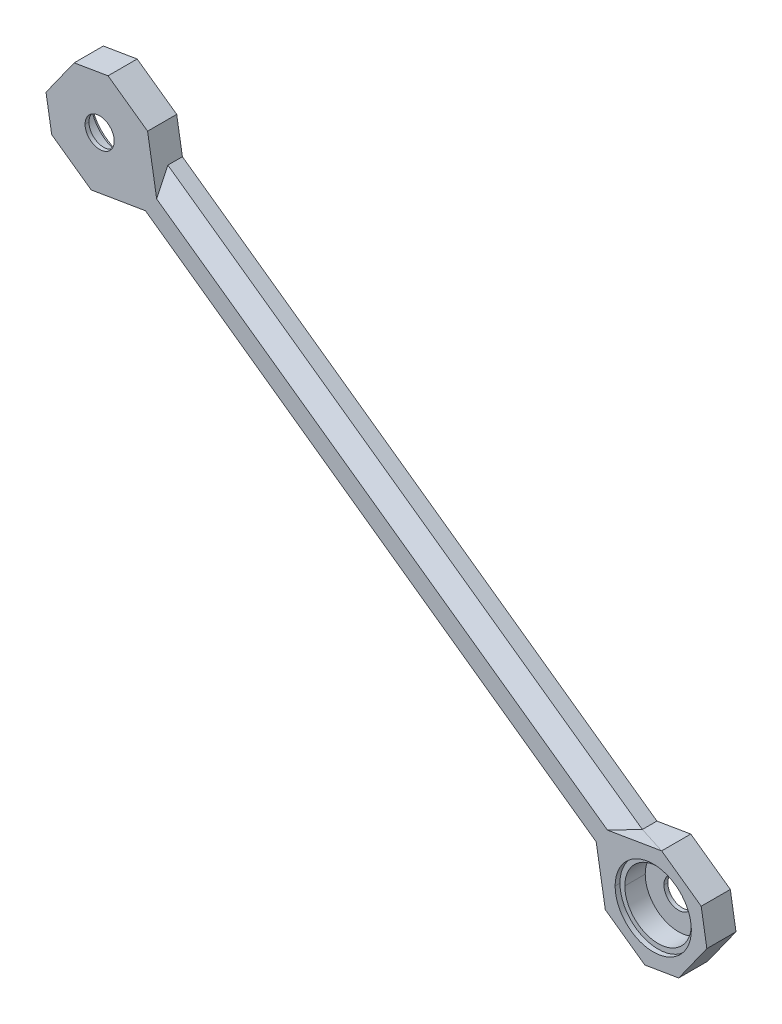
ISO-10303-21;
HEADER;
FILE_DESCRIPTION(('STEP AP214'),'2;1');
FILE_NAME('part.step','',(''),(''),'','','');
FILE_SCHEMA(('AUTOMOTIVE_DESIGN { 1 0 10303 214 1 1 1 1 }'));
ENDSEC;
DATA;
#1=APPLICATION_CONTEXT('core data for automotive mechanical design processes');
#2=APPLICATION_PROTOCOL_DEFINITION('international standard','automotive_design',2000,#1);
#3=PRODUCT_CONTEXT('',#1,'mechanical');
#4=PRODUCT('Part','Part','',(#3));
#5=PRODUCT_RELATED_PRODUCT_CATEGORY('part','',(#4));
#6=PRODUCT_DEFINITION_FORMATION('','',#4);
#7=PRODUCT_DEFINITION_CONTEXT('part definition',#1,'design');
#8=PRODUCT_DEFINITION('design','',#6,#7);
#9=PRODUCT_DEFINITION_SHAPE('','',#8);
#10=(LENGTH_UNIT() NAMED_UNIT(*) SI_UNIT(.MILLI.,.METRE.));
#11=(NAMED_UNIT(*) PLANE_ANGLE_UNIT() SI_UNIT($,.RADIAN.));
#12=(NAMED_UNIT(*) SI_UNIT($,.STERADIAN.) SOLID_ANGLE_UNIT());
#13=UNCERTAINTY_MEASURE_WITH_UNIT(LENGTH_MEASURE(1.E-05),#10,'distance_accuracy_value','');
#14=(GEOMETRIC_REPRESENTATION_CONTEXT(3) GLOBAL_UNCERTAINTY_ASSIGNED_CONTEXT((#13)) GLOBAL_UNIT_ASSIGNED_CONTEXT((#10,
#11,#12)) REPRESENTATION_CONTEXT('',''));
#15=CARTESIAN_POINT('',(0.,0.,0.));
#16=DIRECTION('',(0.,0.,1.));
#17=DIRECTION('',(1.,0.,0.));
#18=AXIS2_PLACEMENT_3D('',#15,#16,#17);
#19=CARTESIAN_POINT('',(24.6033055355398,-560.848772474689,6.00011084027172));
#20=DIRECTION('',(0.,0.,-1.));
#21=DIRECTION('',(-1.,0.,0.));
#22=AXIS2_PLACEMENT_3D('',#19,#20,#21);
#23=CYLINDRICAL_SURFACE('',#22,3.);
#24=DIRECTION('',(0.,0.,-1.));
#25=VECTOR('',#24,1.);
#26=CARTESIAN_POINT('',(27.6033055355398,-560.848772474689,6.00011084027172));
#27=LINE('',#26,#25);
#28=CARTESIAN_POINT('',(27.6033055355398,-560.848772474689,0.800000052154064));
#29=VERTEX_POINT('',#28);
#30=CARTESIAN_POINT('',(27.6033055355398,-560.848772474689,0.));
#31=VERTEX_POINT('',#30);
#32=EDGE_CURVE('E645',#29,#31,#27,.T.);
#33=ORIENTED_EDGE('',*,*,#32,.F.);
#34=CARTESIAN_POINT('',(24.6033055355398,-560.848772474689,0.800000052154064));
#35=DIRECTION('',(0.,0.,1.));
#36=DIRECTION('',(1.,0.,0.));
#37=AXIS2_PLACEMENT_3D('',#34,#35,#36);
#38=CIRCLE('',#37,3.);
#39=CARTESIAN_POINT('',(21.6033055355398,-560.848772474689,0.800000052154064));
#40=VERTEX_POINT('',#39);
#41=EDGE_CURVE('E26',#29,#40,#38,.T.);
#42=ORIENTED_EDGE('',*,*,#41,.T.);
#43=DIRECTION('',(0.,0.,-1.));
#44=VECTOR('',#43,1.);
#45=CARTESIAN_POINT('',(21.6033055355398,-560.848772474689,6.00011084027172));
#46=LINE('',#45,#44);
#47=CARTESIAN_POINT('',(21.6033055355398,-560.848772474689,0.));
#48=VERTEX_POINT('',#47);
#49=EDGE_CURVE('E616',#40,#48,#46,.T.);
#50=ORIENTED_EDGE('',*,*,#49,.T.);
#51=CARTESIAN_POINT('',(24.6033055355398,-560.848772474689,0.));
#52=DIRECTION('',(0.,0.,-1.));
#53=DIRECTION('',(-1.,0.,0.));
#54=AXIS2_PLACEMENT_3D('',#51,#52,#53);
#55=CIRCLE('',#54,3.);
#56=EDGE_CURVE('E338',#48,#31,#55,.T.);
#57=ORIENTED_EDGE('',*,*,#56,.T.);
#58=EDGE_LOOP('',(#33,#42,#50,#57));
#59=FACE_BOUND('',#58,.T.);
#60=ADVANCED_FACE('F16',(#59),#23,.F.);
#61=CARTESIAN_POINT('',(24.6033055355398,-560.848772474689,5.00000005215406));
#62=DIRECTION('',(0.,0.,1.));
#63=DIRECTION('',(1.,0.,0.));
#64=AXIS2_PLACEMENT_3D('',#61,#62,#63);
#65=CYLINDRICAL_SURFACE('',#64,7.85);
#66=DIRECTION('',(0.,0.,1.));
#67=VECTOR('',#66,1.);
#68=CARTESIAN_POINT('',(16.7533055355397,-560.848772474689,5.00000005215406));
#69=LINE('',#68,#67);
#70=CARTESIAN_POINT('',(16.7533055355397,-560.848772474689,5.00000005215406));
#71=VERTEX_POINT('',#70);
#72=CARTESIAN_POINT('',(16.7533055355397,-560.848772474689,6.00000005215406));
#73=VERTEX_POINT('',#72);
#74=EDGE_CURVE('E323',#71,#73,#69,.T.);
#75=ORIENTED_EDGE('',*,*,#74,.F.);
#76=CARTESIAN_POINT('',(24.6033055355398,-560.848772474689,5.00000005215406));
#77=DIRECTION('',(0.,0.,1.));
#78=DIRECTION('',(1.,0.,0.));
#79=AXIS2_PLACEMENT_3D('',#76,#77,#78);
#80=CIRCLE('',#79,7.85);
#81=CARTESIAN_POINT('',(32.4533055355398,-560.848772474689,5.00000005215406));
#82=VERTEX_POINT('',#81);
#83=EDGE_CURVE('E11',#82,#71,#80,.T.);
#84=ORIENTED_EDGE('',*,*,#83,.F.);
#85=DIRECTION('',(0.,0.,1.));
#86=VECTOR('',#85,1.);
#87=CARTESIAN_POINT('',(32.4533055355398,-560.848772474689,5.00000005215406));
#88=LINE('',#87,#86);
#89=CARTESIAN_POINT('',(32.4533055355398,-560.848772474689,6.00000005215406));
#90=VERTEX_POINT('',#89);
#91=EDGE_CURVE('E313',#82,#90,#88,.T.);
#92=ORIENTED_EDGE('',*,*,#91,.T.);
#93=CARTESIAN_POINT('',(24.6033055355398,-560.848772474689,6.00000005215406));
#94=DIRECTION('',(0.,0.,1.));
#95=DIRECTION('',(1.,0.,0.));
#96=AXIS2_PLACEMENT_3D('',#93,#94,#95);
#97=CIRCLE('',#96,7.85);
#98=EDGE_CURVE('E296',#90,#73,#97,.T.);
#99=ORIENTED_EDGE('',*,*,#98,.T.);
#100=EDGE_LOOP('',(#75,#84,#92,#99));
#101=FACE_BOUND('',#100,.T.);
#102=ADVANCED_FACE('F18',(#101),#65,.F.);
#103=CARTESIAN_POINT('',(24.6033055355398,-560.848772474689,5.00000005215406));
#104=DIRECTION('',(0.,0.,1.));
#105=DIRECTION('',(1.,0.,0.));
#106=AXIS2_PLACEMENT_3D('',#103,#104,#105);
#107=PLANE('',#106);
#108=CARTESIAN_POINT('',(24.6033055355398,-560.848772474689,5.00000005215406));
#109=DIRECTION('',(0.,0.,-1.));
#110=DIRECTION('',(1.,0.,0.));
#111=AXIS2_PLACEMENT_3D('',#108,#109,#110);
#112=CIRCLE('',#111,6.85);
#113=CARTESIAN_POINT('',(31.4533055355398,-560.848772474689,5.00000005215406));
#114=VERTEX_POINT('',#113);
#115=CARTESIAN_POINT('',(17.7533055355397,-560.848772474689,5.00000005215406));
#116=VERTEX_POINT('',#115);
#117=EDGE_CURVE('E393',#114,#116,#112,.T.);
#118=ORIENTED_EDGE('',*,*,#117,.T.);
#119=CARTESIAN_POINT('',(24.6033055355398,-560.848772474689,5.00000005215406));
#120=DIRECTION('',(0.,0.,-1.));
#121=DIRECTION('',(1.,0.,0.));
#122=AXIS2_PLACEMENT_3D('',#119,#120,#121);
#123=CIRCLE('',#122,6.85);
#124=EDGE_CURVE('E356',#116,#114,#123,.T.);
#125=ORIENTED_EDGE('',*,*,#124,.T.);
#126=EDGE_LOOP('',(#118,#125));
#127=FACE_BOUND('',#126,.T.);
#128=ORIENTED_EDGE('',*,*,#83,.T.);
#129=CARTESIAN_POINT('',(24.6033055355398,-560.848772474689,5.00000005215406));
#130=DIRECTION('',(0.,0.,1.));
#131=DIRECTION('',(1.,0.,0.));
#132=AXIS2_PLACEMENT_3D('',#129,#130,#131);
#133=CIRCLE('',#132,7.85);
#134=EDGE_CURVE('E619',#71,#82,#133,.T.);
#135=ORIENTED_EDGE('',*,*,#134,.T.);
#136=EDGE_LOOP('',(#128,#135));
#137=FACE_BOUND('',#136,.T.);
#138=ADVANCED_FACE('F754',(#127,#137),#107,.T.);
#139=CARTESIAN_POINT('',(24.6033055355398,-560.848772474689,0.800000052154064));
#140=DIRECTION('',(0.,0.,1.));
#141=DIRECTION('',(1.,0.,0.));
#142=AXIS2_PLACEMENT_3D('',#139,#140,#141);
#143=PLANE('',#142);
#144=CARTESIAN_POINT('',(24.6033055355398,-560.848772474689,0.800000052154064));
#145=DIRECTION('',(0.,0.,1.));
#146=DIRECTION('',(1.,0.,0.));
#147=AXIS2_PLACEMENT_3D('',#144,#145,#146);
#148=CIRCLE('',#147,3.);
#149=EDGE_CURVE('E651',#40,#29,#148,.T.);
#150=ORIENTED_EDGE('',*,*,#149,.F.);
#151=ORIENTED_EDGE('',*,*,#41,.F.);
#152=EDGE_LOOP('',(#150,#151));
#153=FACE_BOUND('',#152,.T.);
#154=CARTESIAN_POINT('',(24.6033055355398,-560.848772474689,0.800000052154064));
#155=DIRECTION('',(0.,0.,1.));
#156=DIRECTION('',(1.,0.,0.));
#157=AXIS2_PLACEMENT_3D('',#154,#155,#156);
#158=CIRCLE('',#157,6.85);
#159=CARTESIAN_POINT('',(31.4533055355398,-560.848772474689,0.800000052154064));
#160=VERTEX_POINT('',#159);
#161=CARTESIAN_POINT('',(17.7533055355397,-560.848772474689,0.800000052154064));
#162=VERTEX_POINT('',#161);
#163=EDGE_CURVE('E401',#160,#162,#158,.T.);
#164=ORIENTED_EDGE('',*,*,#163,.T.);
#165=CARTESIAN_POINT('',(24.6033055355398,-560.848772474689,0.800000052154064));
#166=DIRECTION('',(0.,0.,1.));
#167=DIRECTION('',(1.,0.,0.));
#168=AXIS2_PLACEMENT_3D('',#165,#166,#167);
#169=CIRCLE('',#168,6.85);
#170=EDGE_CURVE('E385',#162,#160,#169,.T.);
#171=ORIENTED_EDGE('',*,*,#170,.T.);
#172=EDGE_LOOP('',(#164,#171));
#173=FACE_BOUND('',#172,.T.);
#174=ADVANCED_FACE('F653',(#153,#173),#143,.T.);
#175=CARTESIAN_POINT('',(-89.4171845608694,-479.565260369701,0.));
#176=DIRECTION('',(0.,0.,1.));
#177=DIRECTION('',(1.,0.,0.));
#178=AXIS2_PLACEMENT_3D('',#175,#176,#177);
#179=CYLINDRICAL_SURFACE('',#178,3.);
#180=DIRECTION('',(0.,0.,1.));
#181=VECTOR('',#180,1.);
#182=CARTESIAN_POINT('',(-92.4171845608694,-479.565260369701,0.));
#183=LINE('',#182,#181);
#184=CARTESIAN_POINT('',(-92.4171845608694,-479.565260369701,5.2));
#185=VERTEX_POINT('',#184);
#186=CARTESIAN_POINT('',(-92.4171845608694,-479.565260369701,6.00000005215406));
#187=VERTEX_POINT('',#186);
#188=EDGE_CURVE('E288',#185,#187,#183,.T.);
#189=ORIENTED_EDGE('',*,*,#188,.F.);
#190=CARTESIAN_POINT('',(-89.4171845608694,-479.565260369701,5.2));
#191=DIRECTION('',(0.,0.,-1.));
#192=DIRECTION('',(-1.,0.,0.));
#193=AXIS2_PLACEMENT_3D('',#190,#191,#192);
#194=CIRCLE('',#193,3.);
#195=CARTESIAN_POINT('',(-86.4171845608694,-479.565260369701,5.2));
#196=VERTEX_POINT('',#195);
#197=EDGE_CURVE('E20',#185,#196,#194,.T.);
#198=ORIENTED_EDGE('',*,*,#197,.T.);
#199=DIRECTION('',(0.,0.,1.));
#200=VECTOR('',#199,1.);
#201=CARTESIAN_POINT('',(-86.4171845608694,-479.565260369701,0.));
#202=LINE('',#201,#200);
#203=CARTESIAN_POINT('',(-86.4171845608694,-479.565260369701,6.00000005215406));
#204=VERTEX_POINT('',#203);
#205=EDGE_CURVE('E291',#196,#204,#202,.T.);
#206=ORIENTED_EDGE('',*,*,#205,.T.);
#207=CARTESIAN_POINT('',(-89.4171845608694,-479.565260369701,6.00000005215406));
#208=DIRECTION('',(0.,0.,1.));
#209=DIRECTION('',(1.,0.,0.));
#210=AXIS2_PLACEMENT_3D('',#207,#208,#209);
#211=CIRCLE('',#210,3.);
#212=EDGE_CURVE('E284',#204,#187,#211,.T.);
#213=ORIENTED_EDGE('',*,*,#212,.T.);
#214=EDGE_LOOP('',(#189,#198,#206,#213));
#215=FACE_BOUND('',#214,.T.);
#216=ADVANCED_FACE('F286',(#215),#179,.F.);
#217=CARTESIAN_POINT('',(-89.4171845608694,-479.565260369701,1.));
#218=DIRECTION('',(0.,0.,-1.));
#219=DIRECTION('',(-1.,0.,0.));
#220=AXIS2_PLACEMENT_3D('',#217,#218,#219);
#221=CYLINDRICAL_SURFACE('',#220,7.85);
#222=DIRECTION('',(0.,0.,-1.));
#223=VECTOR('',#222,1.);
#224=CARTESIAN_POINT('',(-81.5671845608694,-479.565260369701,1.));
#225=LINE('',#224,#223);
#226=CARTESIAN_POINT('',(-81.5671845608694,-479.565260369701,1.));
#227=VERTEX_POINT('',#226);
#228=CARTESIAN_POINT('',(-81.5671845608694,-479.565260369701,0.));
#229=VERTEX_POINT('',#228);
#230=EDGE_CURVE('E333',#227,#229,#225,.T.);
#231=ORIENTED_EDGE('',*,*,#230,.F.);
#232=CARTESIAN_POINT('',(-89.4171845608694,-479.565260369701,1.));
#233=DIRECTION('',(0.,0.,-1.));
#234=DIRECTION('',(-1.,0.,0.));
#235=AXIS2_PLACEMENT_3D('',#232,#233,#234);
#236=CIRCLE('',#235,7.85);
#237=CARTESIAN_POINT('',(-97.2671845608694,-479.565260369701,1.));
#238=VERTEX_POINT('',#237);
#239=EDGE_CURVE('E498',#238,#227,#236,.T.);
#240=ORIENTED_EDGE('',*,*,#239,.F.);
#241=DIRECTION('',(0.,0.,-1.));
#242=VECTOR('',#241,1.);
#243=CARTESIAN_POINT('',(-97.2671845608694,-479.565260369701,1.));
#244=LINE('',#243,#242);
#245=CARTESIAN_POINT('',(-97.2671845608694,-479.565260369701,0.));
#246=VERTEX_POINT('',#245);
#247=EDGE_CURVE('E352',#238,#246,#244,.T.);
#248=ORIENTED_EDGE('',*,*,#247,.T.);
#249=CARTESIAN_POINT('',(-89.4171845608694,-479.565260369701,0.));
#250=DIRECTION('',(0.,0.,-1.));
#251=DIRECTION('',(-1.,0.,0.));
#252=AXIS2_PLACEMENT_3D('',#249,#250,#251);
#253=CIRCLE('',#252,7.85);
#254=EDGE_CURVE('E528',#246,#229,#253,.T.);
#255=ORIENTED_EDGE('',*,*,#254,.T.);
#256=EDGE_LOOP('',(#231,#240,#248,#255));
#257=FACE_BOUND('',#256,.T.);
#258=ADVANCED_FACE('F763',(#257),#221,.F.);
#259=CARTESIAN_POINT('',(-89.4171845608694,-479.565260369701,1.));
#260=DIRECTION('',(0.,0.,-1.));
#261=DIRECTION('',(0.,-1.,0.));
#262=AXIS2_PLACEMENT_3D('',#259,#260,#261);
#263=PLANE('',#262);
#264=CARTESIAN_POINT('',(-89.4171845608694,-479.565260369701,1.));
#265=DIRECTION('',(0.,0.,1.));
#266=DIRECTION('',(-1.,0.,0.));
#267=AXIS2_PLACEMENT_3D('',#264,#265,#266);
#268=CIRCLE('',#267,6.85);
#269=CARTESIAN_POINT('',(-96.2671845608694,-479.565260369701,1.));
#270=VERTEX_POINT('',#269);
#271=CARTESIAN_POINT('',(-82.5671845608694,-479.565260369701,1.));
#272=VERTEX_POINT('',#271);
#273=EDGE_CURVE('E377',#270,#272,#268,.T.);
#274=ORIENTED_EDGE('',*,*,#273,.T.);
#275=CARTESIAN_POINT('',(-89.4171845608694,-479.565260369701,1.));
#276=DIRECTION('',(0.,0.,1.));
#277=DIRECTION('',(-1.,0.,0.));
#278=AXIS2_PLACEMENT_3D('',#275,#276,#277);
#279=CIRCLE('',#278,6.85);
#280=EDGE_CURVE('E355',#272,#270,#279,.T.);
#281=ORIENTED_EDGE('',*,*,#280,.T.);
#282=EDGE_LOOP('',(#274,#281));
#283=FACE_BOUND('',#282,.T.);
#284=ORIENTED_EDGE('',*,*,#239,.T.);
#285=CARTESIAN_POINT('',(-89.4171845608694,-479.565260369701,1.));
#286=DIRECTION('',(0.,0.,-1.));
#287=DIRECTION('',(-1.,0.,0.));
#288=AXIS2_PLACEMENT_3D('',#285,#286,#287);
#289=CIRCLE('',#288,7.85);
#290=EDGE_CURVE('E329',#227,#238,#289,.T.);
#291=ORIENTED_EDGE('',*,*,#290,.T.);
#292=EDGE_LOOP('',(#284,#291));
#293=FACE_BOUND('',#292,.T.);
#294=ADVANCED_FACE('F599',(#283,#293),#263,.T.);
#295=CARTESIAN_POINT('',(-89.4171845608694,-479.565260369701,5.2));
#296=DIRECTION('',(0.,0.,-1.));
#297=DIRECTION('',(0.,-1.,0.));
#298=AXIS2_PLACEMENT_3D('',#295,#296,#297);
#299=PLANE('',#298);
#300=CARTESIAN_POINT('',(-89.4171845608694,-479.565260369701,5.2));
#301=DIRECTION('',(0.,0.,-1.));
#302=DIRECTION('',(-1.,0.,0.));
#303=AXIS2_PLACEMENT_3D('',#300,#301,#302);
#304=CIRCLE('',#303,3.);
#305=EDGE_CURVE('E306',#196,#185,#304,.T.);
#306=ORIENTED_EDGE('',*,*,#305,.F.);
#307=ORIENTED_EDGE('',*,*,#197,.F.);
#308=EDGE_LOOP('',(#306,#307));
#309=FACE_BOUND('',#308,.T.);
#310=CARTESIAN_POINT('',(-89.4171845608694,-479.565260369701,5.2));
#311=DIRECTION('',(0.,0.,-1.));
#312=DIRECTION('',(-1.,0.,0.));
#313=AXIS2_PLACEMENT_3D('',#310,#311,#312);
#314=CIRCLE('',#313,6.85);
#315=CARTESIAN_POINT('',(-96.2671845608694,-479.565260369701,5.2));
#316=VERTEX_POINT('',#315);
#317=CARTESIAN_POINT('',(-82.5671845608694,-479.565260369701,5.2));
#318=VERTEX_POINT('',#317);
#319=EDGE_CURVE('E353',#316,#318,#314,.T.);
#320=ORIENTED_EDGE('',*,*,#319,.T.);
#321=CARTESIAN_POINT('',(-89.4171845608694,-479.565260369701,5.2));
#322=DIRECTION('',(0.,0.,-1.));
#323=DIRECTION('',(-1.,0.,0.));
#324=AXIS2_PLACEMENT_3D('',#321,#322,#323);
#325=CIRCLE('',#324,6.85);
#326=EDGE_CURVE('E369',#318,#316,#325,.T.);
#327=ORIENTED_EDGE('',*,*,#326,.T.);
#328=EDGE_LOOP('',(#320,#327));
#329=FACE_BOUND('',#328,.T.);
#330=ADVANCED_FACE('F595',(#309,#329),#299,.T.);
#331=CARTESIAN_POINT('',(-130.702600269057,-183.449846891505,225.248478101957));
#332=DIRECTION('',(0.410305243249622,0.575890869026152,-0.707106296347425));
#333=DIRECTION('',(-0.864933709462389,0.,-0.501886120784019));
#334=AXIS2_PLACEMENT_3D('',#331,#332,#333);
#335=PLANE('',#334);
#336=DIRECTION('',(-0.805225730620787,-0.135196284193927,-0.577350402690061));
#337=VECTOR('',#336,1.);
#338=CARTESIAN_POINT('',(-79.9900889396667,-488.78476023674,6.00000005215406));
#339=LINE('',#338,#337);
#340=CARTESIAN_POINT('',(-79.9900889396667,-488.78476023674,6.00000005215401));
#341=VERTEX_POINT('',#340);
#342=CARTESIAN_POINT('',(-84.1741667524352,-489.487264949212,3.00000539072693));
#343=VERTEX_POINT('',#342);
#344=EDGE_CURVE('E50',#341,#343,#339,.T.);
#345=ORIENTED_EDGE('',*,*,#344,.T.);
#346=DIRECTION('',(-0.814432067114109,0.580258914671925,0.));
#347=VECTOR('',#346,1.);
#348=CARTESIAN_POINT('',(13.5576846078038,-559.118330478668,3.00000002607703));
#349=LINE('',#348,#347);
#350=CARTESIAN_POINT('',(13.5576846078038,-559.118330478668,3.000000026077));
#351=VERTEX_POINT('',#350);
#352=EDGE_CURVE('E440',#351,#343,#349,.T.);
#353=ORIENTED_EDGE('',*,*,#352,.F.);
#354=DIRECTION('',(-0.135199959433498,0.80522483621177,0.577350789483231));
#355=VECTOR('',#354,1.);
#356=CARTESIAN_POINT('',(13.5576846078038,-559.118330478668,3.00000002607703));
#357=LINE('',#356,#355);
#358=CARTESIAN_POINT('',(12.8551656380297,-554.93426322937,6.00000005215405));
#359=VERTEX_POINT('',#358);
#360=EDGE_CURVE('E40',#351,#359,#357,.T.);
#361=ORIENTED_EDGE('',*,*,#360,.T.);
#362=DIRECTION('',(0.814432118995538,-0.580258841852874,0.));
#363=VECTOR('',#362,1.);
#364=CARTESIAN_POINT('',(-79.9900889396667,-488.78476023674,6.00000005215406));
#365=LINE('',#364,#363);
#366=EDGE_CURVE('E448',#341,#359,#365,.T.);
#367=ORIENTED_EDGE('',*,*,#366,.F.);
#368=EDGE_LOOP('',(#345,#353,#361,#367));
#369=FACE_BOUND('',#368,.T.);
#370=ADVANCED_FACE('F598',(#369),#335,.F.);
#371=CARTESIAN_POINT('',(-126.061025782532,-176.935088232061,-217.248489458046));
#372=DIRECTION('',(0.410306049118392,0.575892005893627,0.707104902828902));
#373=DIRECTION('',(0.814432121746203,-0.580258837992131,0.));
#374=AXIS2_PLACEMENT_3D('',#371,#372,#373);
#375=PLANE('',#374);
#376=DIRECTION('',(0.814432171415295,-0.580258768278229,0.));
#377=VECTOR('',#376,1.);
#378=CARTESIAN_POINT('',(-78.3715695142746,-481.342971324921,3.00000002607703));
#379=LINE('',#378,#377);
#380=CARTESIAN_POINT('',(-78.3715665341136,-481.342967142066,3.00000516196629));
#381=VERTEX_POINT('',#380);
#382=CARTESIAN_POINT('',(19.3602740764618,-550.974011421204,3.00000002607686));
#383=VERTEX_POINT('',#382);
#384=EDGE_CURVE('E522',#381,#383,#379,.T.);
#385=ORIENTED_EDGE('',*,*,#384,.F.);
#386=DIRECTION('',(-0.135199880003315,0.805222897584278,-0.57735351185653));
#387=VECTOR('',#386,1.);
#388=CARTESIAN_POINT('',(-77.6690542697907,-485.527008771896,6.00000005215406));
#389=LINE('',#388,#387);
#390=CARTESIAN_POINT('',(-77.6690481823151,-485.527012877944,5.99999986393853));
#391=VERTEX_POINT('',#390);
#392=EDGE_CURVE('E523',#391,#381,#389,.T.);
#393=ORIENTED_EDGE('',*,*,#392,.F.);
#394=DIRECTION('',(-0.81443212174621,0.580258837992121,0.));
#395=VECTOR('',#394,1.);
#396=CARTESIAN_POINT('',(15.1762012392283,-551.676511764526,6.00000005215406));
#397=LINE('',#396,#395);
#398=CARTESIAN_POINT('',(15.1762012392282,-551.676511764527,6.00000005215392));
#399=VERTEX_POINT('',#398);
#400=EDGE_CURVE('E419',#399,#391,#397,.T.);
#401=ORIENTED_EDGE('',*,*,#400,.F.);
#402=DIRECTION('',(-0.805225604579849,-0.135196323217841,0.577350569340149));
#403=VECTOR('',#402,1.);
#404=CARTESIAN_POINT('',(19.3602740764618,-550.974011421204,3.00000002607703));
#405=LINE('',#404,#403);
#406=EDGE_CURVE('E556',#383,#399,#405,.T.);
#407=ORIENTED_EDGE('',*,*,#406,.F.);
#408=EDGE_LOOP('',(#385,#393,#401,#407));
#409=FACE_BOUND('',#408,.T.);
#410=ADVANCED_FACE('F737',(#409),#375,.T.);
#411=CARTESIAN_POINT('',(289.51045146156,-206.267774443975,0.));
#412=DIRECTION('',(0.814431953554727,-0.580259074060054,0.));
#413=DIRECTION('',(0.,0.,-1.));
#414=AXIS2_PLACEMENT_3D('',#411,#412,#413);
#415=PLANE('',#414);
#416=DIRECTION('',(0.580259074060054,0.814431953554727,0.));
#417=VECTOR('',#416,1.);
#418=CARTESIAN_POINT('',(29.8463255167007,-570.723533630371,0.));
#419=LINE('',#418,#417);
#420=CARTESIAN_POINT('',(29.8463255167007,-570.723533630371,0.));
#421=VERTEX_POINT('',#420);
#422=CARTESIAN_POINT('',(35.6489159166813,-562.579214572907,0.));
#423=VERTEX_POINT('',#422);
#424=EDGE_CURVE('E490',#421,#423,#419,.T.);
#425=ORIENTED_EDGE('',*,*,#424,.T.);
#426=DIRECTION('',(0.,0.,1.));
#427=VECTOR('',#426,1.);
#428=CARTESIAN_POINT('',(35.6489159166813,-562.579214572907,0.));
#429=LINE('',#428,#427);
#430=CARTESIAN_POINT('',(35.6489159166813,-562.579214572907,6.00000005215406));
#431=VERTEX_POINT('',#430);
#432=EDGE_CURVE('E584',#423,#431,#429,.T.);
#433=ORIENTED_EDGE('',*,*,#432,.T.);
#434=DIRECTION('',(0.580259074060054,0.814431953554727,0.));
#435=VECTOR('',#434,1.);
#436=CARTESIAN_POINT('',(29.8463255167007,-570.723533630371,6.00000005215406));
#437=LINE('',#436,#435);
#438=CARTESIAN_POINT('',(29.8463255167007,-570.723533630371,6.00000005215406));
#439=VERTEX_POINT('',#438);
#440=EDGE_CURVE('E412',#439,#431,#437,.T.);
#441=ORIENTED_EDGE('',*,*,#440,.F.);
#442=DIRECTION('',(0.,0.,1.));
#443=VECTOR('',#442,1.);
#444=CARTESIAN_POINT('',(29.8463255167007,-570.723533630371,0.));
#445=LINE('',#444,#443);
#446=EDGE_CURVE('E582',#421,#439,#445,.T.);
#447=ORIENTED_EDGE('',*,*,#446,.F.);
#448=EDGE_LOOP('',(#425,#433,#441,#447));
#449=FACE_BOUND('',#448,.T.);
#450=ADVANCED_FACE('F715',(#449),#415,.T.);
#451=CARTESIAN_POINT('',(-57.1976345466679,-9.60368548510984,0.));
#452=DIRECTION('',(0.986195404157694,0.165585702336409,0.));
#453=DIRECTION('',(0.,0.,-1.));
#454=AXIS2_PLACEMENT_3D('',#451,#452,#453);
#455=PLANE('',#454);
#456=DIRECTION('',(-0.165585702336409,0.986195404157694,0.));
#457=VECTOR('',#456,1.);
#458=CARTESIAN_POINT('',(35.6489159166813,-562.579214572907,6.00000005215406));
#459=LINE('',#458,#457);
#460=CARTESIAN_POINT('',(34.4780497252941,-555.60576915741,6.00000005215406));
#461=VERTEX_POINT('',#460);
#462=EDGE_CURVE('E344',#431,#461,#459,.T.);
#463=ORIENTED_EDGE('',*,*,#462,.F.);
#464=ORIENTED_EDGE('',*,*,#432,.F.);
#465=DIRECTION('',(-0.165585702336409,0.986195404157694,0.));
#466=VECTOR('',#465,1.);
#467=CARTESIAN_POINT('',(35.6489159166813,-562.579214572907,0.));
#468=LINE('',#467,#466);
#469=CARTESIAN_POINT('',(34.4780497252941,-555.60576915741,0.));
#470=VERTEX_POINT('',#469);
#471=EDGE_CURVE('E486',#423,#470,#468,.T.);
#472=ORIENTED_EDGE('',*,*,#471,.T.);
#473=DIRECTION('',(0.,0.,1.));
#474=VECTOR('',#473,1.);
#475=CARTESIAN_POINT('',(34.4780497252941,-555.60576915741,0.));
#476=LINE('',#475,#474);
#477=EDGE_CURVE('E543',#470,#461,#476,.T.);
#478=ORIENTED_EDGE('',*,*,#477,.T.);
#479=EDGE_LOOP('',(#463,#464,#472,#478));
#480=FACE_BOUND('',#479,.T.);
#481=ADVANCED_FACE('F711',(#480),#455,.T.);
#482=CARTESIAN_POINT('',(94.0178684560138,-559.948850045983,0.));
#483=DIRECTION('',(0.165586512036771,-0.986195268205793,0.));
#484=DIRECTION('',(0.,0.,-1.));
#485=AXIS2_PLACEMENT_3D('',#482,#483,#484);
#486=PLANE('',#485);
#487=DIRECTION('',(0.986195268205793,0.165586512036771,0.));
#488=VECTOR('',#487,1.);
#489=CARTESIAN_POINT('',(22.8728707879781,-571.894407272339,0.));
#490=LINE('',#489,#488);
#491=CARTESIAN_POINT('',(22.8728707879781,-571.894407272339,0.));
#492=VERTEX_POINT('',#491);
#493=EDGE_CURVE('E494',#492,#421,#490,.T.);
#494=ORIENTED_EDGE('',*,*,#493,.T.);
#495=ORIENTED_EDGE('',*,*,#446,.T.);
#496=DIRECTION('',(0.986195268205793,0.165586512036771,0.));
#497=VECTOR('',#496,1.);
#498=CARTESIAN_POINT('',(22.8728707879781,-571.894407272339,6.00000005215406));
#499=LINE('',#498,#497);
#500=CARTESIAN_POINT('',(22.8728707879781,-571.894407272339,6.00000005215406));
#501=VERTEX_POINT('',#500);
#502=EDGE_CURVE('E367',#501,#439,#499,.T.);
#503=ORIENTED_EDGE('',*,*,#502,.F.);
#504=DIRECTION('',(0.,0.,1.));
#505=VECTOR('',#504,1.);
#506=CARTESIAN_POINT('',(22.8728707879781,-571.894407272339,0.));
#507=LINE('',#506,#505);
#508=EDGE_CURVE('E539',#492,#501,#507,.T.);
#509=ORIENTED_EDGE('',*,*,#508,.F.);
#510=EDGE_LOOP('',(#494,#495,#503,#509));
#511=FACE_BOUND('',#510,.T.);
#512=ADVANCED_FACE('F718',(#511),#486,.T.);
#513=CARTESIAN_POINT('',(-78.1179235721551,-13.1162656978368,0.));
#514=DIRECTION('',(-0.98619542566576,-0.165585574238613,0.));
#515=DIRECTION('',(-0.165585574238613,0.98619542566576,0.));
#516=AXIS2_PLACEMENT_3D('',#513,#514,#515);
#517=PLANE('',#516);
#518=DIRECTION('',(0.,0.,-1.));
#519=VECTOR('',#518,1.);
#520=CARTESIAN_POINT('',(14.7285498678684,-566.091775894165,6.00000005215406));
#521=LINE('',#520,#519);
#522=CARTESIAN_POINT('',(14.7285498678684,-566.091775894165,6.00000005215406));
#523=VERTEX_POINT('',#522);
#524=CARTESIAN_POINT('',(14.7285498678684,-566.091775894165,0.));
#525=VERTEX_POINT('',#524);
#526=EDGE_CURVE('E542',#523,#525,#521,.T.);
#527=ORIENTED_EDGE('',*,*,#526,.F.);
#528=DIRECTION('',(0.165585558226387,-0.986195428354267,0.));
#529=VECTOR('',#528,1.);
#530=CARTESIAN_POINT('',(12.8551656380296,-554.93426322937,6.00000005215406));
#531=LINE('',#530,#529);
#532=EDGE_CURVE('E368',#359,#523,#531,.T.);
#533=ORIENTED_EDGE('',*,*,#532,.F.);
#534=ORIENTED_EDGE('',*,*,#360,.F.);
#535=DIRECTION('',(0.,0.,-1.));
#536=VECTOR('',#535,1.);
#537=CARTESIAN_POINT('',(13.5576846078038,-559.118330478668,3.00000002607703));
#538=LINE('',#537,#536);
#539=CARTESIAN_POINT('',(13.5576846078038,-559.118330478668,0.));
#540=VERTEX_POINT('',#539);
#541=EDGE_CURVE('E442',#351,#540,#538,.T.);
#542=ORIENTED_EDGE('',*,*,#541,.T.);
#543=DIRECTION('',(0.165585574238613,-0.98619542566576,0.));
#544=VECTOR('',#543,1.);
#545=CARTESIAN_POINT('',(13.5576846078038,-559.118330478668,0.));
#546=LINE('',#545,#544);
#547=EDGE_CURVE('E469',#540,#525,#546,.T.);
#548=ORIENTED_EDGE('',*,*,#547,.T.);
#549=EDGE_LOOP('',(#527,#533,#534,#542,#548));
#550=FACE_BOUND('',#549,.T.);
#551=ADVANCED_FACE('F724',(#550),#517,.T.);
#552=CARTESIAN_POINT('',(-262.565958897122,-368.526155219514,0.));
#553=DIRECTION('',(-0.580261704106491,-0.81443007971675,0.));
#554=DIRECTION('',(-0.81443007971675,0.580261704106491,0.));
#555=AXIS2_PLACEMENT_3D('',#552,#553,#554);
#556=PLANE('',#555);
#557=DIRECTION('',(0.81443007971675,-0.580261704106491,0.));
#558=VECTOR('',#557,1.);
#559=CARTESIAN_POINT('',(14.7285498678684,-566.091775894165,0.));
#560=LINE('',#559,#558);
#561=EDGE_CURVE('E474',#525,#492,#560,.T.);
#562=ORIENTED_EDGE('',*,*,#561,.T.);
#563=ORIENTED_EDGE('',*,*,#508,.T.);
#564=DIRECTION('',(-0.81443007971675,0.580261704106491,0.));
#565=VECTOR('',#564,1.);
#566=CARTESIAN_POINT('',(22.8728707879781,-571.894407272339,6.00000005215406));
#567=LINE('',#566,#565);
#568=EDGE_CURVE('E363',#501,#523,#567,.T.);
#569=ORIENTED_EDGE('',*,*,#568,.T.);
#570=ORIENTED_EDGE('',*,*,#526,.T.);
#571=EDGE_LOOP('',(#562,#563,#569,#570));
#572=FACE_BOUND('',#571,.T.);
#573=ADVANCED_FACE('F721',(#572),#556,.T.);
#574=CARTESIAN_POINT('',(-250.960726123455,-352.237555461681,0.));
#575=DIRECTION('',(0.580261704106491,0.81443007971675,0.));
#576=DIRECTION('',(0.,0.,-1.));
#577=AXIS2_PLACEMENT_3D('',#574,#575,#576);
#578=PLANE('',#577);
#579=DIRECTION('',(-0.81443007971675,0.580261704106491,0.));
#580=VECTOR('',#579,1.);
#581=CARTESIAN_POINT('',(34.4780497252941,-555.60576915741,6.00000005215406));
#582=LINE('',#581,#580);
#583=CARTESIAN_POINT('',(26.3337288051844,-549.803137779236,6.00000005215406));
#584=VERTEX_POINT('',#583);
#585=EDGE_CURVE('E340',#461,#584,#582,.T.);
#586=ORIENTED_EDGE('',*,*,#585,.F.);
#587=ORIENTED_EDGE('',*,*,#477,.F.);
#588=DIRECTION('',(0.81443007971675,-0.580261704106491,0.));
#589=VECTOR('',#588,1.);
#590=CARTESIAN_POINT('',(26.3337288051844,-549.803137779236,0.));
#591=LINE('',#590,#589);
#592=CARTESIAN_POINT('',(26.3337288051844,-549.803137779236,0.));
#593=VERTEX_POINT('',#592);
#594=EDGE_CURVE('E482',#593,#470,#591,.T.);
#595=ORIENTED_EDGE('',*,*,#594,.F.);
#596=DIRECTION('',(0.,0.,-1.));
#597=VECTOR('',#596,1.);
#598=CARTESIAN_POINT('',(26.3337288051844,-549.803137779236,6.00000005215406));
#599=LINE('',#598,#597);
#600=EDGE_CURVE('E324',#584,#593,#599,.T.);
#601=ORIENTED_EDGE('',*,*,#600,.F.);
#602=EDGE_LOOP('',(#586,#587,#595,#601));
#603=FACE_BOUND('',#602,.T.);
#604=ADVANCED_FACE('F709',(#603),#578,.T.);
#605=CARTESIAN_POINT('',(90.5041500427496,-539.028809444477,0.00267738503594632));
#606=DIRECTION('',(-0.16558446247261,0.986195612322252,-4.89848655337875E-06));
#607=DIRECTION('',(-2.95830084422659E-05,0.,0.999999999562423));
#608=AXIS2_PLACEMENT_3D('',#605,#606,#607);
#609=PLANE('',#608);
#610=DIRECTION('',(0.907866353071504,0.152434743551501,0.390566683063259));
#611=VECTOR('',#610,1.);
#612=CARTESIAN_POINT('',(19.3602740764618,-550.974011421204,3.00000002607703));
#613=LINE('',#612,#611);
#614=EDGE_CURVE('E328',#383,#584,#613,.T.);
#615=ORIENTED_EDGE('',*,*,#614,.F.);
#616=ORIENTED_EDGE('',*,*,#406,.T.);
#617=DIRECTION('',(-0.986195612334084,-0.165584462474596,0.));
#618=VECTOR('',#617,1.);
#619=CARTESIAN_POINT('',(26.3337288051844,-549.803137779236,6.00000005215406));
#620=LINE('',#619,#618);
#621=EDGE_CURVE('E317',#584,#399,#620,.T.);
#622=ORIENTED_EDGE('',*,*,#621,.F.);
#623=EDGE_LOOP('',(#615,#616,#622));
#624=FACE_BOUND('',#623,.T.);
#625=ADVANCED_FACE('F772',(#624),#609,.T.);
#626=CARTESIAN_POINT('',(77.6247110762013,-462.320850205347,-0.00234456824753168));
#627=DIRECTION('',(0.165584462472526,-0.98619561232175,-5.00129491775601E-06));
#628=DIRECTION('',(0.,5.0713011244467E-06,-0.999999999987141));
#629=AXIS2_PLACEMENT_3D('',#626,#627,#628);
#630=PLANE('',#629);
#631=DIRECTION('',(-0.907866310445912,-0.152434777110581,0.390566769047974));
#632=VECTOR('',#631,1.);
#633=CARTESIAN_POINT('',(-84.1741636395454,-489.487260580063,3.00000002607703));
#634=LINE('',#633,#632);
#635=CARTESIAN_POINT('',(-91.1476165056229,-490.658134222031,6.00000005215406));
#636=VERTEX_POINT('',#635);
#637=EDGE_CURVE('E462',#343,#636,#634,.T.);
#638=ORIENTED_EDGE('',*,*,#637,.F.);
#639=ORIENTED_EDGE('',*,*,#344,.F.);
#640=DIRECTION('',(-0.986195612334084,-0.165584462474596,0.));
#641=VECTOR('',#640,1.);
#642=CARTESIAN_POINT('',(-79.9900889396667,-488.78476023674,6.00000005215406));
#643=LINE('',#642,#641);
#644=EDGE_CURVE('E444',#341,#636,#643,.T.);
#645=ORIENTED_EDGE('',*,*,#644,.T.);
#646=EDGE_LOOP('',(#638,#639,#645));
#647=FACE_BOUND('',#646,.T.);
#648=ADVANCED_FACE('F735',(#647),#630,.T.);
#649=CARTESIAN_POINT('',(-259.664083093238,-364.45584996912,0.));
#650=DIRECTION('',(0.580258914671925,0.814432067114109,0.));
#651=DIRECTION('',(0.,0.,-1.));
#652=AXIS2_PLACEMENT_3D('',#649,#650,#651);
#653=PLANE('',#652);
#654=DIRECTION('',(0.,0.,1.));
#655=VECTOR('',#654,1.);
#656=CARTESIAN_POINT('',(-84.1741636395454,-489.487260580063,0.));
#657=LINE('',#656,#655);
#658=CARTESIAN_POINT('',(-84.1741636395454,-489.487260580063,0.));
#659=VERTEX_POINT('',#658);
#660=EDGE_CURVE('E327',#659,#343,#657,.T.);
#661=ORIENTED_EDGE('',*,*,#660,.F.);
#662=DIRECTION('',(0.814432067114109,-0.580258914671925,0.));
#663=VECTOR('',#662,1.);
#664=CARTESIAN_POINT('',(-84.1741636395454,-489.487260580063,0.));
#665=LINE('',#664,#663);
#666=EDGE_CURVE('E473',#659,#540,#665,.T.);
#667=ORIENTED_EDGE('',*,*,#666,.T.);
#668=ORIENTED_EDGE('',*,*,#541,.F.);
#669=ORIENTED_EDGE('',*,*,#352,.T.);
#670=EDGE_LOOP('',(#661,#667,#668,#669));
#671=FACE_BOUND('',#670,.T.);
#672=ADVANCED_FACE('F727',(#671),#653,.F.);
#673=CARTESIAN_POINT('',(77.6256369026728,-462.320356985992,0.));
#674=DIRECTION('',(-0.16558655505307,0.986195260983167,0.));
#675=DIRECTION('',(0.,0.,1.));
#676=AXIS2_PLACEMENT_3D('',#673,#674,#675);
#677=PLANE('',#676);
#678=ORIENTED_EDGE('',*,*,#660,.T.);
#679=ORIENTED_EDGE('',*,*,#637,.T.);
#680=DIRECTION('',(0.,0.,1.));
#681=VECTOR('',#680,1.);
#682=CARTESIAN_POINT('',(-91.1476165056229,-490.658134222031,0.));
#683=LINE('',#682,#681);
#684=CARTESIAN_POINT('',(-91.1476165056229,-490.658134222031,0.));
#685=VERTEX_POINT('',#684);
#686=EDGE_CURVE('E546',#685,#636,#683,.T.);
#687=ORIENTED_EDGE('',*,*,#686,.F.);
#688=DIRECTION('',(0.986195260983167,0.16558655505307,0.));
#689=VECTOR('',#688,1.);
#690=CARTESIAN_POINT('',(-91.1476165056229,-490.658134222031,0.));
#691=LINE('',#690,#689);
#692=EDGE_CURVE('E509',#685,#659,#691,.T.);
#693=ORIENTED_EDGE('',*,*,#692,.T.);
#694=EDGE_LOOP('',(#678,#679,#687,#693));
#695=FACE_BOUND('',#694,.T.);
#696=ADVANCED_FACE('F730',(#695),#677,.F.);
#697=CARTESIAN_POINT('',(90.5052430231328,-539.02845901729,0.));
#698=DIRECTION('',(0.165586512036771,-0.986195268205793,0.));
#699=DIRECTION('',(0.,0.,-1.));
#700=AXIS2_PLACEMENT_3D('',#697,#698,#699);
#701=PLANE('',#700);
#702=DIRECTION('',(0.,0.,1.));
#703=VECTOR('',#702,1.);
#704=CARTESIAN_POINT('',(19.3602740764618,-550.974011421204,0.));
#705=LINE('',#704,#703);
#706=CARTESIAN_POINT('',(19.3602740764618,-550.974011421204,0.));
#707=VERTEX_POINT('',#706);
#708=EDGE_CURVE('E565',#707,#383,#705,.T.);
#709=ORIENTED_EDGE('',*,*,#708,.T.);
#710=ORIENTED_EDGE('',*,*,#614,.T.);
#711=ORIENTED_EDGE('',*,*,#600,.T.);
#712=DIRECTION('',(-0.986195268205793,-0.165586512036771,0.));
#713=VECTOR('',#712,1.);
#714=CARTESIAN_POINT('',(26.3337288051844,-549.803137779236,0.));
#715=LINE('',#714,#713);
#716=EDGE_CURVE('E478',#593,#707,#715,.T.);
#717=ORIENTED_EDGE('',*,*,#716,.T.);
#718=EDGE_LOOP('',(#709,#710,#711,#717));
#719=FACE_BOUND('',#718,.T.);
#720=ADVANCED_FACE('F704',(#719),#701,.F.);
#721=CARTESIAN_POINT('',(-253.861465544377,-356.31162495909,0.));
#722=DIRECTION('',(-0.580258768278229,-0.814432171415295,0.));
#723=DIRECTION('',(-0.814432171415295,0.580258768278229,0.));
#724=AXIS2_PLACEMENT_3D('',#721,#722,#723);
#725=PLANE('',#724);
#726=DIRECTION('',(0.,0.,-1.));
#727=VECTOR('',#726,1.);
#728=CARTESIAN_POINT('',(-78.3715695142746,-481.342971324921,3.00000002607703));
#729=LINE('',#728,#727);
#730=CARTESIAN_POINT('',(-78.3715695142746,-481.342971324921,0.));
#731=VERTEX_POINT('',#730);
#732=EDGE_CURVE('E519',#381,#731,#729,.T.);
#733=ORIENTED_EDGE('',*,*,#732,.F.);
#734=ORIENTED_EDGE('',*,*,#384,.T.);
#735=ORIENTED_EDGE('',*,*,#708,.F.);
#736=DIRECTION('',(-0.814432171415295,0.580258768278229,0.));
#737=VECTOR('',#736,1.);
#738=CARTESIAN_POINT('',(19.3602740764618,-550.974011421204,0.));
#739=LINE('',#738,#737);
#740=EDGE_CURVE('E468',#707,#731,#739,.T.);
#741=ORIENTED_EDGE('',*,*,#740,.T.);
#742=EDGE_LOOP('',(#733,#734,#735,#741));
#743=FACE_BOUND('',#742,.T.);
#744=ADVANCED_FACE('F699',(#743),#725,.F.);
#745=CARTESIAN_POINT('',(74.113015372945,-441.39999479152,0.));
#746=DIRECTION('',(-0.16558655505307,0.986195260983167,0.));
#747=DIRECTION('',(0.,0.,1.));
#748=AXIS2_PLACEMENT_3D('',#745,#746,#747);
#749=PLANE('',#748);
#750=DIRECTION('',(-0.986195260983167,-0.16558655505307,0.));
#751=VECTOR('',#750,1.);
#752=CARTESIAN_POINT('',(-87.686762213707,-468.56689453125,0.));
#753=LINE('',#752,#751);
#754=CARTESIAN_POINT('',(-87.686762213707,-468.56689453125,0.));
#755=VERTEX_POINT('',#754);
#756=CARTESIAN_POINT('',(-94.6602150797844,-469.737768173218,0.));
#757=VERTEX_POINT('',#756);
#758=EDGE_CURVE('E339',#755,#757,#753,.T.);
#759=ORIENTED_EDGE('',*,*,#758,.T.);
#760=DIRECTION('',(0.,0.,1.));
#761=VECTOR('',#760,1.);
#762=CARTESIAN_POINT('',(-94.6602150797844,-469.737768173218,0.));
#763=LINE('',#762,#761);
#764=CARTESIAN_POINT('',(-94.6602150797844,-469.737768173218,6.00000005215406));
#765=VERTEX_POINT('',#764);
#766=EDGE_CURVE('E532',#757,#765,#763,.T.);
#767=ORIENTED_EDGE('',*,*,#766,.T.);
#768=DIRECTION('',(0.986195260983167,0.16558655505307,0.));
#769=VECTOR('',#768,1.);
#770=CARTESIAN_POINT('',(-94.6602150797844,-469.737768173218,6.00000005215406));
#771=LINE('',#770,#769);
#772=CARTESIAN_POINT('',(-87.686762213707,-468.56689453125,6.00000005215406));
#773=VERTEX_POINT('',#772);
#774=EDGE_CURVE('E431',#765,#773,#771,.T.);
#775=ORIENTED_EDGE('',*,*,#774,.T.);
#776=DIRECTION('',(0.,0.,1.));
#777=VECTOR('',#776,1.);
#778=CARTESIAN_POINT('',(-87.686762213707,-468.56689453125,0.));
#779=LINE('',#778,#777);
#780=EDGE_CURVE('E550',#755,#773,#779,.T.);
#781=ORIENTED_EDGE('',*,*,#780,.F.);
#782=EDGE_LOOP('',(#759,#767,#775,#781));
#783=FACE_BOUND('',#782,.T.);
#784=ADVANCED_FACE('F691',(#783),#749,.T.);
#785=CARTESIAN_POINT('',(-154.825668387373,-25.9956671546599,0.));
#786=DIRECTION('',(0.986195519717988,0.165585014080885,0.));
#787=DIRECTION('',(0.,0.,-1.));
#788=AXIS2_PLACEMENT_3D('',#785,#786,#787);
#789=PLANE('',#788);
#790=DIRECTION('',(0.,0.,-1.));
#791=VECTOR('',#790,1.);
#792=CARTESIAN_POINT('',(-79.5424357056618,-474.369496107101,6.00000005215406));
#793=LINE('',#792,#791);
#794=CARTESIAN_POINT('',(-79.5424357056618,-474.369496107101,6.00000005215406));
#795=VERTEX_POINT('',#794);
#796=CARTESIAN_POINT('',(-79.5424357056618,-474.369496107101,0.));
#797=VERTEX_POINT('',#796);
#798=EDGE_CURVE('E553',#795,#797,#793,.T.);
#799=ORIENTED_EDGE('',*,*,#798,.F.);
#800=DIRECTION('',(0.165585318042993,-0.986195468681844,0.));
#801=VECTOR('',#800,1.);
#802=CARTESIAN_POINT('',(-79.5424357056618,-474.369496107101,6.00000005215406));
#803=LINE('',#802,#801);
#804=EDGE_CURVE('E423',#795,#391,#803,.T.);
#805=ORIENTED_EDGE('',*,*,#804,.T.);
#806=ORIENTED_EDGE('',*,*,#392,.T.);
#807=ORIENTED_EDGE('',*,*,#732,.T.);
#808=DIRECTION('',(-0.165585014080885,0.986195519717988,0.));
#809=VECTOR('',#808,1.);
#810=CARTESIAN_POINT('',(-78.3715695142746,-481.342971324921,0.));
#811=LINE('',#810,#809);
#812=EDGE_CURVE('E295',#731,#797,#811,.T.);
#813=ORIENTED_EDGE('',*,*,#812,.T.);
#814=EDGE_LOOP('',(#799,#805,#806,#807,#813));
#815=FACE_BOUND('',#814,.T.);
#816=ADVANCED_FACE('F696',(#815),#789,.T.);
#817=CARTESIAN_POINT('',(-250.960358086277,-352.239089676026,0.));
#818=DIRECTION('',(0.580259463253697,0.814431676265438,0.));
#819=DIRECTION('',(0.,0.,-1.));
#820=AXIS2_PLACEMENT_3D('',#817,#818,#819);
#821=PLANE('',#820);
#822=DIRECTION('',(-0.814431676265438,0.580259463253697,0.));
#823=VECTOR('',#822,1.);
#824=CARTESIAN_POINT('',(-79.5424357056618,-474.369496107101,0.));
#825=LINE('',#824,#823);
#826=EDGE_CURVE('E334',#797,#755,#825,.T.);
#827=ORIENTED_EDGE('',*,*,#826,.T.);
#828=ORIENTED_EDGE('',*,*,#780,.T.);
#829=DIRECTION('',(0.814431676265438,-0.580259463253697,0.));
#830=VECTOR('',#829,1.);
#831=CARTESIAN_POINT('',(-87.686762213707,-468.56689453125,6.00000005215406));
#832=LINE('',#831,#830);
#833=EDGE_CURVE('E427',#773,#795,#832,.T.);
#834=ORIENTED_EDGE('',*,*,#833,.T.);
#835=ORIENTED_EDGE('',*,*,#798,.T.);
#836=EDGE_LOOP('',(#827,#828,#834,#835));
#837=FACE_BOUND('',#836,.T.);
#838=ADVANCED_FACE('F843',(#837),#821,.T.);
#839=CARTESIAN_POINT('',(-262.565653194173,-368.527534622462,0.));
#840=DIRECTION('',(-0.58025981535423,-0.814431425403683,0.));
#841=DIRECTION('',(-0.814431425403683,0.58025981535423,0.));
#842=AXIS2_PLACEMENT_3D('',#839,#840,#841);
#843=PLANE('',#842);
#844=DIRECTION('',(0.814431425403683,-0.58025981535423,0.));
#845=VECTOR('',#844,1.);
#846=CARTESIAN_POINT('',(-99.2919355630875,-484.855532646179,0.));
#847=LINE('',#846,#845);
#848=CARTESIAN_POINT('',(-99.2919355630875,-484.855532646179,0.));
#849=VERTEX_POINT('',#848);
#850=EDGE_CURVE('E510',#849,#685,#847,.T.);
#851=ORIENTED_EDGE('',*,*,#850,.T.);
#852=ORIENTED_EDGE('',*,*,#686,.T.);
#853=DIRECTION('',(0.814431425403683,-0.58025981535423,0.));
#854=VECTOR('',#853,1.);
#855=CARTESIAN_POINT('',(-99.2919355630875,-484.855532646179,6.00000005215406));
#856=LINE('',#855,#854);
#857=CARTESIAN_POINT('',(-99.2919355630875,-484.855532646179,6.00000005215406));
#858=VERTEX_POINT('',#857);
#859=EDGE_CURVE('E449',#858,#636,#856,.T.);
#860=ORIENTED_EDGE('',*,*,#859,.F.);
#861=DIRECTION('',(0.,0.,1.));
#862=VECTOR('',#861,1.);
#863=CARTESIAN_POINT('',(-99.2919355630875,-484.855532646179,0.));
#864=LINE('',#863,#862);
#865=EDGE_CURVE('E538',#849,#858,#864,.T.);
#866=ORIENTED_EDGE('',*,*,#865,.F.);
#867=EDGE_LOOP('',(#851,#852,#860,#866));
#868=FACE_BOUND('',#867,.T.);
#869=ADVANCED_FACE('F732',(#868),#843,.T.);
#870=CARTESIAN_POINT('',(-175.746327175569,-29.5084309820589,0.));
#871=DIRECTION('',(-0.986195404157694,-0.165585702336409,0.));
#872=DIRECTION('',(-0.165585702336409,0.986195404157694,0.));
#873=AXIS2_PLACEMENT_3D('',#870,#871,#872);
#874=PLANE('',#873);
#875=DIRECTION('',(0.165585702336409,-0.986195404157694,0.));
#876=VECTOR('',#875,1.);
#877=CARTESIAN_POINT('',(-100.462801754475,-477.882087230682,0.));
#878=LINE('',#877,#876);
#879=CARTESIAN_POINT('',(-100.462801754475,-477.882087230682,0.));
#880=VERTEX_POINT('',#879);
#881=EDGE_CURVE('E514',#880,#849,#878,.T.);
#882=ORIENTED_EDGE('',*,*,#881,.T.);
#883=ORIENTED_EDGE('',*,*,#865,.T.);
#884=DIRECTION('',(0.165585702336409,-0.986195404157694,0.));
#885=VECTOR('',#884,1.);
#886=CARTESIAN_POINT('',(-100.462801754475,-477.882087230682,6.00000005215406));
#887=LINE('',#886,#885);
#888=CARTESIAN_POINT('',(-100.462801754475,-477.882087230682,6.00000005215406));
#889=VERTEX_POINT('',#888);
#890=EDGE_CURVE('E439',#889,#858,#887,.T.);
#891=ORIENTED_EDGE('',*,*,#890,.F.);
#892=DIRECTION('',(0.,0.,1.));
#893=VECTOR('',#892,1.);
#894=CARTESIAN_POINT('',(-100.462801754475,-477.882087230682,0.));
#895=LINE('',#894,#893);
#896=EDGE_CURVE('E535',#880,#889,#895,.T.);
#897=ORIENTED_EDGE('',*,*,#896,.F.);
#898=EDGE_LOOP('',(#882,#883,#891,#897));
#899=FACE_BOUND('',#898,.T.);
#900=ADVANCED_FACE('F684',(#899),#874,.T.);
#901=CARTESIAN_POINT('',(159.201255553948,-113.426190397663,0.));
#902=DIRECTION('',(-0.814432129605077,0.580258826961675,0.));
#903=DIRECTION('',(0.,0.,1.));
#904=AXIS2_PLACEMENT_3D('',#901,#902,#903);
#905=PLANE('',#904);
#906=DIRECTION('',(-0.580258826961675,-0.814432129605077,0.));
#907=VECTOR('',#906,1.);
#908=CARTESIAN_POINT('',(-94.6602150797844,-469.737768173218,6.00000005215406));
#909=LINE('',#908,#907);
#910=EDGE_CURVE('E435',#765,#889,#909,.T.);
#911=ORIENTED_EDGE('',*,*,#910,.F.);
#912=ORIENTED_EDGE('',*,*,#766,.F.);
#913=DIRECTION('',(-0.580258826961675,-0.814432129605077,0.));
#914=VECTOR('',#913,1.);
#915=CARTESIAN_POINT('',(-94.6602150797844,-469.737768173218,0.));
#916=LINE('',#915,#914);
#917=EDGE_CURVE('E518',#757,#880,#916,.T.);
#918=ORIENTED_EDGE('',*,*,#917,.T.);
#919=ORIENTED_EDGE('',*,*,#896,.T.);
#920=EDGE_LOOP('',(#911,#912,#918,#919));
#921=FACE_BOUND('',#920,.T.);
#922=ADVANCED_FACE('F675',(#921),#905,.T.);
#923=CARTESIAN_POINT('',(0.,0.,0.));
#924=DIRECTION('',(0.,0.,1.));
#925=DIRECTION('',(1.,0.,0.));
#926=AXIS2_PLACEMENT_3D('',#923,#924,#925);
#927=PLANE('',#926);
#928=ORIENTED_EDGE('',*,*,#254,.F.);
#929=CARTESIAN_POINT('',(-89.4171845608694,-479.565260369701,0.));
#930=DIRECTION('',(0.,0.,-1.));
#931=DIRECTION('',(-1.,0.,0.));
#932=AXIS2_PLACEMENT_3D('',#929,#930,#931);
#933=CIRCLE('',#932,7.85);
#934=EDGE_CURVE('E348',#229,#246,#933,.T.);
#935=ORIENTED_EDGE('',*,*,#934,.F.);
#936=EDGE_LOOP('',(#928,#935));
#937=FACE_BOUND('',#936,.T.);
#938=ORIENTED_EDGE('',*,*,#56,.F.);
#939=CARTESIAN_POINT('',(24.6033055355398,-560.848772474689,0.));
#940=DIRECTION('',(0.,0.,-1.));
#941=DIRECTION('',(-1.,0.,0.));
#942=AXIS2_PLACEMENT_3D('',#939,#940,#941);
#943=CIRCLE('',#942,3.);
#944=EDGE_CURVE('E633',#31,#48,#943,.T.);
#945=ORIENTED_EDGE('',*,*,#944,.F.);
#946=EDGE_LOOP('',(#938,#945));
#947=FACE_BOUND('',#946,.T.);
#948=ORIENTED_EDGE('',*,*,#812,.F.);
#949=ORIENTED_EDGE('',*,*,#740,.F.);
#950=ORIENTED_EDGE('',*,*,#716,.F.);
#951=ORIENTED_EDGE('',*,*,#594,.T.);
#952=ORIENTED_EDGE('',*,*,#471,.F.);
#953=ORIENTED_EDGE('',*,*,#424,.F.);
#954=ORIENTED_EDGE('',*,*,#493,.F.);
#955=ORIENTED_EDGE('',*,*,#561,.F.);
#956=ORIENTED_EDGE('',*,*,#547,.F.);
#957=ORIENTED_EDGE('',*,*,#666,.F.);
#958=ORIENTED_EDGE('',*,*,#692,.F.);
#959=ORIENTED_EDGE('',*,*,#850,.F.);
#960=ORIENTED_EDGE('',*,*,#881,.F.);
#961=ORIENTED_EDGE('',*,*,#917,.F.);
#962=ORIENTED_EDGE('',*,*,#758,.F.);
#963=ORIENTED_EDGE('',*,*,#826,.F.);
#964=EDGE_LOOP('',(#948,#949,#950,#951,#952,#953,#954,#955,#956,#957,#958,#959,#960,#961,#962,#963));
#965=FACE_BOUND('',#964,.T.);
#966=ADVANCED_FACE('F681',(#937,#947,#965),#927,.F.);
#967=CARTESIAN_POINT('',(0.,0.,6.00000005215406));
#968=DIRECTION('',(0.,0.,-1.));
#969=DIRECTION('',(0.,-1.,0.));
#970=AXIS2_PLACEMENT_3D('',#967,#968,#969);
#971=PLANE('',#970);
#972=ORIENTED_EDGE('',*,*,#212,.F.);
#973=CARTESIAN_POINT('',(-89.4171845608694,-479.565260369701,6.00000005215406));
#974=DIRECTION('',(0.,0.,1.));
#975=DIRECTION('',(1.,0.,0.));
#976=AXIS2_PLACEMENT_3D('',#973,#974,#975);
#977=CIRCLE('',#976,3.);
#978=EDGE_CURVE('E298',#187,#204,#977,.T.);
#979=ORIENTED_EDGE('',*,*,#978,.F.);
#980=EDGE_LOOP('',(#972,#979));
#981=FACE_BOUND('',#980,.T.);
#982=ORIENTED_EDGE('',*,*,#98,.F.);
#983=CARTESIAN_POINT('',(24.6033055355398,-560.848772474689,6.00000005215406));
#984=DIRECTION('',(0.,0.,1.));
#985=DIRECTION('',(1.,0.,0.));
#986=AXIS2_PLACEMENT_3D('',#983,#984,#985);
#987=CIRCLE('',#986,7.85);
#988=EDGE_CURVE('E319',#73,#90,#987,.T.);
#989=ORIENTED_EDGE('',*,*,#988,.F.);
#990=EDGE_LOOP('',(#982,#989));
#991=FACE_BOUND('',#990,.T.);
#992=ORIENTED_EDGE('',*,*,#532,.T.);
#993=ORIENTED_EDGE('',*,*,#568,.F.);
#994=ORIENTED_EDGE('',*,*,#502,.T.);
#995=ORIENTED_EDGE('',*,*,#440,.T.);
#996=ORIENTED_EDGE('',*,*,#462,.T.);
#997=ORIENTED_EDGE('',*,*,#585,.T.);
#998=ORIENTED_EDGE('',*,*,#621,.T.);
#999=ORIENTED_EDGE('',*,*,#400,.T.);
#1000=ORIENTED_EDGE('',*,*,#804,.F.);
#1001=ORIENTED_EDGE('',*,*,#833,.F.);
#1002=ORIENTED_EDGE('',*,*,#774,.F.);
#1003=ORIENTED_EDGE('',*,*,#910,.T.);
#1004=ORIENTED_EDGE('',*,*,#890,.T.);
#1005=ORIENTED_EDGE('',*,*,#859,.T.);
#1006=ORIENTED_EDGE('',*,*,#644,.F.);
#1007=ORIENTED_EDGE('',*,*,#366,.T.);
#1008=EDGE_LOOP('',(#992,#993,#994,#995,#996,#997,#998,#999,#1000,#1001,#1002,#1003,#1004,#1005,
#1006,#1007));
#1009=FACE_BOUND('',#1008,.T.);
#1010=ADVANCED_FACE('F299',(#981,#991,#1009),#971,.F.);
#1011=CARTESIAN_POINT('',(-89.4171845608694,-479.565260369701,5.2));
#1012=DIRECTION('',(0.,0.,-1.));
#1013=DIRECTION('',(-1.,0.,0.));
#1014=AXIS2_PLACEMENT_3D('',#1011,#1012,#1013);
#1015=CYLINDRICAL_SURFACE('',#1014,6.85);
#1016=DIRECTION('',(0.,0.,-1.));
#1017=VECTOR('',#1016,1.);
#1018=CARTESIAN_POINT('',(-82.5671845608694,-479.565260369701,5.2));
#1019=LINE('',#1018,#1017);
#1020=EDGE_CURVE('E373',#318,#272,#1019,.T.);
#1021=ORIENTED_EDGE('',*,*,#1020,.F.);
#1022=ORIENTED_EDGE('',*,*,#319,.F.);
#1023=DIRECTION('',(0.,0.,-1.));
#1024=VECTOR('',#1023,1.);
#1025=CARTESIAN_POINT('',(-96.2671845608694,-479.565260369701,5.2));
#1026=LINE('',#1025,#1024);
#1027=EDGE_CURVE('E381',#316,#270,#1026,.T.);
#1028=ORIENTED_EDGE('',*,*,#1027,.T.);
#1029=ORIENTED_EDGE('',*,*,#280,.F.);
#1030=EDGE_LOOP('',(#1021,#1022,#1028,#1029));
#1031=FACE_BOUND('',#1030,.T.);
#1032=ADVANCED_FACE('F605',(#1031),#1015,.F.);
#1033=CARTESIAN_POINT('',(24.6033055355398,-560.848772474689,0.800000052154064));
#1034=DIRECTION('',(0.,0.,1.));
#1035=DIRECTION('',(1.,0.,0.));
#1036=AXIS2_PLACEMENT_3D('',#1033,#1034,#1035);
#1037=CYLINDRICAL_SURFACE('',#1036,6.85);
#1038=DIRECTION('',(0.,0.,1.));
#1039=VECTOR('',#1038,1.);
#1040=CARTESIAN_POINT('',(17.7533055355397,-560.848772474689,0.800000052154064));
#1041=LINE('',#1040,#1039);
#1042=EDGE_CURVE('E389',#162,#116,#1041,.T.);
#1043=ORIENTED_EDGE('',*,*,#1042,.F.);
#1044=ORIENTED_EDGE('',*,*,#163,.F.);
#1045=DIRECTION('',(0.,0.,1.));
#1046=VECTOR('',#1045,1.);
#1047=CARTESIAN_POINT('',(31.4533055355398,-560.848772474689,0.800000052154064));
#1048=LINE('',#1047,#1046);
#1049=EDGE_CURVE('E397',#160,#114,#1048,.T.);
#1050=ORIENTED_EDGE('',*,*,#1049,.T.);
#1051=ORIENTED_EDGE('',*,*,#124,.F.);
#1052=EDGE_LOOP('',(#1043,#1044,#1050,#1051));
#1053=FACE_BOUND('',#1052,.T.);
#1054=ADVANCED_FACE('F812',(#1053),#1037,.F.);
#1055=CARTESIAN_POINT('',(24.6033055355398,-560.848772474689,0.800000052154064));
#1056=DIRECTION('',(0.,0.,1.));
#1057=DIRECTION('',(1.,0.,0.));
#1058=AXIS2_PLACEMENT_3D('',#1055,#1056,#1057);
#1059=CYLINDRICAL_SURFACE('',#1058,6.85);
#1060=ORIENTED_EDGE('',*,*,#170,.F.);
#1061=ORIENTED_EDGE('',*,*,#1042,.T.);
#1062=ORIENTED_EDGE('',*,*,#117,.F.);
#1063=ORIENTED_EDGE('',*,*,#1049,.F.);
#1064=EDGE_LOOP('',(#1060,#1061,#1062,#1063));
#1065=FACE_BOUND('',#1064,.T.);
#1066=ADVANCED_FACE('F825',(#1065),#1059,.F.);
#1067=CARTESIAN_POINT('',(-89.4171845608694,-479.565260369701,5.2));
#1068=DIRECTION('',(0.,0.,-1.));
#1069=DIRECTION('',(-1.,0.,0.));
#1070=AXIS2_PLACEMENT_3D('',#1067,#1068,#1069);
#1071=CYLINDRICAL_SURFACE('',#1070,6.85);
#1072=ORIENTED_EDGE('',*,*,#326,.F.);
#1073=ORIENTED_EDGE('',*,*,#1020,.T.);
#1074=ORIENTED_EDGE('',*,*,#273,.F.);
#1075=ORIENTED_EDGE('',*,*,#1027,.F.);
#1076=EDGE_LOOP('',(#1072,#1073,#1074,#1075));
#1077=FACE_BOUND('',#1076,.T.);
#1078=ADVANCED_FACE('F608',(#1077),#1071,.F.);
#1079=CARTESIAN_POINT('',(-89.4171845608694,-479.565260369701,1.));
#1080=DIRECTION('',(0.,0.,-1.));
#1081=DIRECTION('',(-1.,0.,0.));
#1082=AXIS2_PLACEMENT_3D('',#1079,#1080,#1081);
#1083=CYLINDRICAL_SURFACE('',#1082,7.85);
#1084=ORIENTED_EDGE('',*,*,#290,.F.);
#1085=ORIENTED_EDGE('',*,*,#230,.T.);
#1086=ORIENTED_EDGE('',*,*,#934,.T.);
#1087=ORIENTED_EDGE('',*,*,#247,.F.);
#1088=EDGE_LOOP('',(#1084,#1085,#1086,#1087));
#1089=FACE_BOUND('',#1088,.T.);
#1090=ADVANCED_FACE('F831',(#1089),#1083,.F.);
#1091=CARTESIAN_POINT('',(-89.4171845608694,-479.565260369701,0.));
#1092=DIRECTION('',(0.,0.,1.));
#1093=DIRECTION('',(1.,0.,0.));
#1094=AXIS2_PLACEMENT_3D('',#1091,#1092,#1093);
#1095=CYLINDRICAL_SURFACE('',#1094,3.);
#1096=ORIENTED_EDGE('',*,*,#305,.T.);
#1097=ORIENTED_EDGE('',*,*,#188,.T.);
#1098=ORIENTED_EDGE('',*,*,#978,.T.);
#1099=ORIENTED_EDGE('',*,*,#205,.F.);
#1100=EDGE_LOOP('',(#1096,#1097,#1098,#1099));
#1101=FACE_BOUND('',#1100,.T.);
#1102=ADVANCED_FACE('F304',(#1101),#1095,.F.);
#1103=CARTESIAN_POINT('',(24.6033055355398,-560.848772474689,5.00000005215406));
#1104=DIRECTION('',(0.,0.,1.));
#1105=DIRECTION('',(1.,0.,0.));
#1106=AXIS2_PLACEMENT_3D('',#1103,#1104,#1105);
#1107=CYLINDRICAL_SURFACE('',#1106,7.85);
#1108=ORIENTED_EDGE('',*,*,#134,.F.);
#1109=ORIENTED_EDGE('',*,*,#74,.T.);
#1110=ORIENTED_EDGE('',*,*,#988,.T.);
#1111=ORIENTED_EDGE('',*,*,#91,.F.);
#1112=EDGE_LOOP('',(#1108,#1109,#1110,#1111));
#1113=FACE_BOUND('',#1112,.T.);
#1114=ADVANCED_FACE('F804',(#1113),#1107,.F.);
#1115=CARTESIAN_POINT('',(24.6033055355398,-560.848772474689,6.00011084027172));
#1116=DIRECTION('',(0.,0.,-1.));
#1117=DIRECTION('',(-1.,0.,0.));
#1118=AXIS2_PLACEMENT_3D('',#1115,#1116,#1117);
#1119=CYLINDRICAL_SURFACE('',#1118,3.);
#1120=ORIENTED_EDGE('',*,*,#149,.T.);
#1121=ORIENTED_EDGE('',*,*,#32,.T.);
#1122=ORIENTED_EDGE('',*,*,#944,.T.);
#1123=ORIENTED_EDGE('',*,*,#49,.F.);
#1124=EDGE_LOOP('',(#1120,#1121,#1122,#1123));
#1125=FACE_BOUND('',#1124,.T.);
#1126=ADVANCED_FACE('F650',(#1125),#1119,.F.);
#1127=CLOSED_SHELL('',(#60,#102,#138,#174,#216,#258,#294,#330,#370,#410,#450,#481,#512,#551,
#573,#604,#625,#648,#672,#696,#720,#744,#784,#816,#838,#869,#900,#922,#966,#1010,#1032,#1054,
#1066,#1078,#1090,#1102,#1114,#1126));
#1128=MANIFOLD_SOLID_BREP('B1',#1127);
#1129=ADVANCED_BREP_SHAPE_REPRESENTATION('',(#18,#1128),#14);
#1130=SHAPE_DEFINITION_REPRESENTATION(#9,#1129);
ENDSEC;
END-ISO-10303-21;
